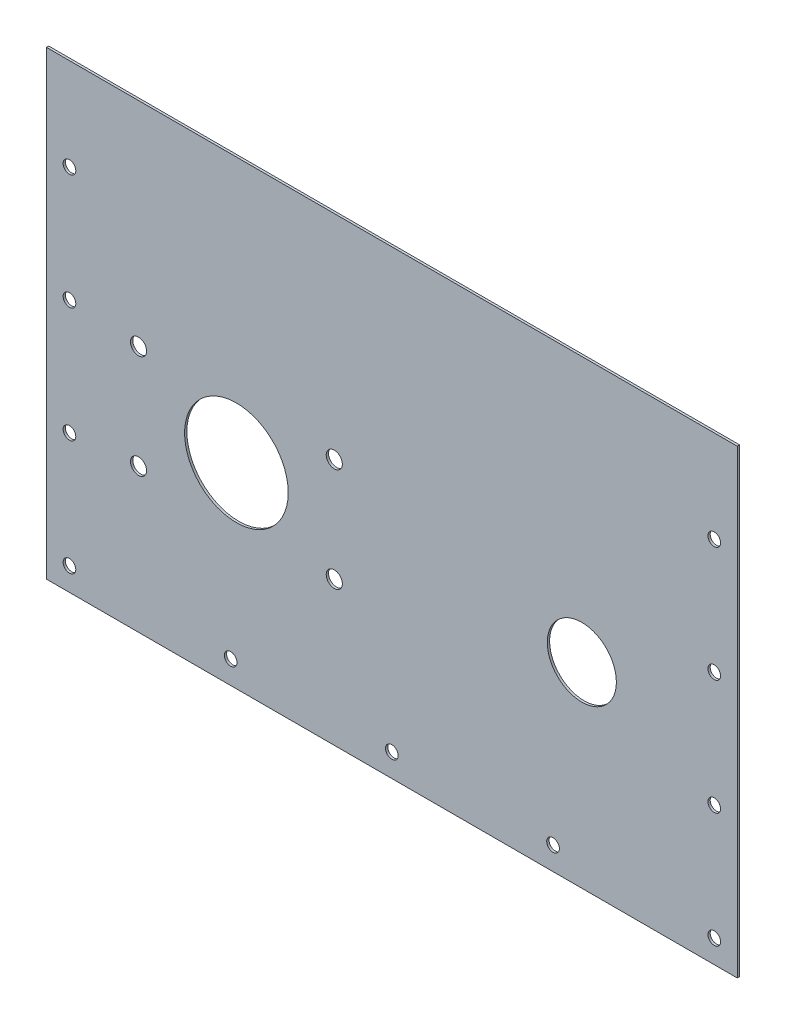
ISO-10303-21;
HEADER;
FILE_DESCRIPTION(('STEP AP214'),'2;1');
FILE_NAME('part.step','',(''),(''),'','','');
FILE_SCHEMA(('AUTOMOTIVE_DESIGN { 1 0 10303 214 1 1 1 1 }'));
ENDSEC;
DATA;
#1=APPLICATION_CONTEXT('core data for automotive mechanical design processes');
#2=APPLICATION_PROTOCOL_DEFINITION('international standard','automotive_design',2000,#1);
#3=PRODUCT_CONTEXT('',#1,'mechanical');
#4=PRODUCT('Part','Part','',(#3));
#5=PRODUCT_RELATED_PRODUCT_CATEGORY('part','',(#4));
#6=PRODUCT_DEFINITION_FORMATION('','',#4);
#7=PRODUCT_DEFINITION_CONTEXT('part definition',#1,'design');
#8=PRODUCT_DEFINITION('design','',#6,#7);
#9=PRODUCT_DEFINITION_SHAPE('','',#8);
#10=(LENGTH_UNIT() NAMED_UNIT(*) SI_UNIT(.MILLI.,.METRE.));
#11=(NAMED_UNIT(*) PLANE_ANGLE_UNIT() SI_UNIT($,.RADIAN.));
#12=(NAMED_UNIT(*) SI_UNIT($,.STERADIAN.) SOLID_ANGLE_UNIT());
#13=UNCERTAINTY_MEASURE_WITH_UNIT(LENGTH_MEASURE(1.E-05),#10,'distance_accuracy_value','');
#14=(GEOMETRIC_REPRESENTATION_CONTEXT(3) GLOBAL_UNCERTAINTY_ASSIGNED_CONTEXT((#13)) GLOBAL_UNIT_ASSIGNED_CONTEXT((#10,
#11,#12)) REPRESENTATION_CONTEXT('',''));
#15=CARTESIAN_POINT('',(0.,0.,0.));
#16=DIRECTION('',(0.,0.,1.));
#17=DIRECTION('',(1.,0.,0.));
#18=AXIS2_PLACEMENT_3D('',#15,#16,#17);
#19=CARTESIAN_POINT('',(-150.,-110.,1.));
#20=DIRECTION('',(-1.,0.,0.));
#21=DIRECTION('',(0.,0.,1.));
#22=AXIS2_PLACEMENT_3D('',#19,#20,#21);
#23=PLANE('',#22);
#24=DIRECTION('',(0.,0.,1.));
#25=VECTOR('',#24,1.);
#26=CARTESIAN_POINT('',(-150.,90.,-9.));
#27=LINE('',#26,#25);
#28=CARTESIAN_POINT('',(-150.,90.,0.));
#29=VERTEX_POINT('',#28);
#30=CARTESIAN_POINT('',(-150.,90.,1.));
#31=VERTEX_POINT('',#30);
#32=EDGE_CURVE('E92',#29,#31,#27,.T.);
#33=ORIENTED_EDGE('',*,*,#32,.F.);
#34=DIRECTION('',(0.,1.,0.));
#35=VECTOR('',#34,1.);
#36=CARTESIAN_POINT('',(-150.,-110.,0.));
#37=LINE('',#36,#35);
#38=CARTESIAN_POINT('',(-150.,-110.,0.));
#39=VERTEX_POINT('',#38);
#40=EDGE_CURVE('E85',#39,#29,#37,.T.);
#41=ORIENTED_EDGE('',*,*,#40,.F.);
#42=DIRECTION('',(0.,0.,-1.));
#43=VECTOR('',#42,1.);
#44=CARTESIAN_POINT('',(-150.,-110.,1.));
#45=LINE('',#44,#43);
#46=CARTESIAN_POINT('',(-150.,-110.,1.));
#47=VERTEX_POINT('',#46);
#48=EDGE_CURVE('E45',#47,#39,#45,.T.);
#49=ORIENTED_EDGE('',*,*,#48,.F.);
#50=DIRECTION('',(0.,1.,0.));
#51=VECTOR('',#50,1.);
#52=CARTESIAN_POINT('',(-150.,-110.,1.));
#53=LINE('',#52,#51);
#54=EDGE_CURVE('E88',#47,#31,#53,.T.);
#55=ORIENTED_EDGE('',*,*,#54,.T.);
#56=EDGE_LOOP('',(#33,#41,#49,#55));
#57=FACE_BOUND('',#56,.T.);
#58=ADVANCED_FACE('F37',(#57),#23,.T.);
#59=CARTESIAN_POINT('',(-150.,-110.,1.));
#60=DIRECTION('',(0.,1.,0.));
#61=DIRECTION('',(0.,0.,1.));
#62=AXIS2_PLACEMENT_3D('',#59,#60,#61);
#63=PLANE('',#62);
#64=DIRECTION('',(1.,0.,0.));
#65=VECTOR('',#64,1.);
#66=CARTESIAN_POINT('',(-150.,-110.,0.));
#67=LINE('',#66,#65);
#68=CARTESIAN_POINT('',(150.,-110.,0.));
#69=VERTEX_POINT('',#68);
#70=EDGE_CURVE('E74',#39,#69,#67,.T.);
#71=ORIENTED_EDGE('',*,*,#70,.T.);
#72=DIRECTION('',(0.,0.,-1.));
#73=VECTOR('',#72,1.);
#74=CARTESIAN_POINT('',(150.,-110.,1.));
#75=LINE('',#74,#73);
#76=CARTESIAN_POINT('',(150.,-110.,1.));
#77=VERTEX_POINT('',#76);
#78=EDGE_CURVE('E78',#77,#69,#75,.T.);
#79=ORIENTED_EDGE('',*,*,#78,.F.);
#80=DIRECTION('',(1.,0.,0.));
#81=VECTOR('',#80,1.);
#82=CARTESIAN_POINT('',(-150.,-110.,1.));
#83=LINE('',#82,#81);
#84=EDGE_CURVE('E76',#47,#77,#83,.T.);
#85=ORIENTED_EDGE('',*,*,#84,.F.);
#86=ORIENTED_EDGE('',*,*,#48,.T.);
#87=EDGE_LOOP('',(#71,#79,#85,#86));
#88=FACE_BOUND('',#87,.T.);
#89=ADVANCED_FACE('F72',(#88),#63,.F.);
#90=CARTESIAN_POINT('',(150.,-110.,1.));
#91=DIRECTION('',(-1.,0.,0.));
#92=DIRECTION('',(0.,0.,1.));
#93=AXIS2_PLACEMENT_3D('',#90,#91,#92);
#94=PLANE('',#93);
#95=DIRECTION('',(0.,1.,0.));
#96=VECTOR('',#95,1.);
#97=CARTESIAN_POINT('',(150.,-110.,0.));
#98=LINE('',#97,#96);
#99=CARTESIAN_POINT('',(150.,90.,0.));
#100=VERTEX_POINT('',#99);
#101=EDGE_CURVE('E87',#69,#100,#98,.T.);
#102=ORIENTED_EDGE('',*,*,#101,.T.);
#103=DIRECTION('',(0.,0.,1.));
#104=VECTOR('',#103,1.);
#105=CARTESIAN_POINT('',(150.,90.,-9.));
#106=LINE('',#105,#104);
#107=CARTESIAN_POINT('',(150.,90.,1.));
#108=VERTEX_POINT('',#107);
#109=EDGE_CURVE('E52',#100,#108,#106,.T.);
#110=ORIENTED_EDGE('',*,*,#109,.T.);
#111=DIRECTION('',(0.,1.,0.));
#112=VECTOR('',#111,1.);
#113=CARTESIAN_POINT('',(150.,-110.,1.));
#114=LINE('',#113,#112);
#115=EDGE_CURVE('E193',#77,#108,#114,.T.);
#116=ORIENTED_EDGE('',*,*,#115,.F.);
#117=ORIENTED_EDGE('',*,*,#78,.T.);
#118=EDGE_LOOP('',(#102,#110,#116,#117));
#119=FACE_BOUND('',#118,.T.);
#120=ADVANCED_FACE('F199',(#119),#94,.F.);
#121=CARTESIAN_POINT('',(0.,0.,1.));
#122=DIRECTION('',(0.,0.,-1.));
#123=DIRECTION('',(-1.,0.,0.));
#124=AXIS2_PLACEMENT_3D('',#121,#122,#123);
#125=PLANE('',#124);
#126=CARTESIAN_POINT('',(82.5,-25.,1.));
#127=DIRECTION('',(0.,0.,1.));
#128=DIRECTION('',(1.,0.,0.));
#129=AXIS2_PLACEMENT_3D('',#126,#127,#128);
#130=CIRCLE('',#129,15.);
#131=CARTESIAN_POINT('',(97.5,-25.,1.));
#132=VERTEX_POINT('',#131);
#133=EDGE_CURVE('E519',#132,#132,#130,.T.);
#134=ORIENTED_EDGE('',*,*,#133,.F.);
#135=EDGE_LOOP('',(#134));
#136=FACE_BOUND('',#135,.T.);
#137=CARTESIAN_POINT('',(-110.,-2.50000000000002,1.));
#138=DIRECTION('',(0.,0.,1.));
#139=DIRECTION('',(1.,0.,0.));
#140=AXIS2_PLACEMENT_3D('',#137,#138,#139);
#141=CIRCLE('',#140,3.50000000000001);
#142=CARTESIAN_POINT('',(-106.5,-2.50000000000002,1.));
#143=VERTEX_POINT('',#142);
#144=EDGE_CURVE('E520',#143,#143,#141,.T.);
#145=ORIENTED_EDGE('',*,*,#144,.F.);
#146=EDGE_LOOP('',(#145));
#147=FACE_BOUND('',#146,.T.);
#148=CARTESIAN_POINT('',(-110.,-47.5,1.));
#149=DIRECTION('',(0.,0.,1.));
#150=DIRECTION('',(1.,0.,0.));
#151=AXIS2_PLACEMENT_3D('',#148,#149,#150);
#152=CIRCLE('',#151,3.50000000000001);
#153=CARTESIAN_POINT('',(-106.5,-47.5,1.));
#154=VERTEX_POINT('',#153);
#155=EDGE_CURVE('E524',#154,#154,#152,.T.);
#156=ORIENTED_EDGE('',*,*,#155,.F.);
#157=EDGE_LOOP('',(#156));
#158=FACE_BOUND('',#157,.T.);
#159=CARTESIAN_POINT('',(-25.,-47.5,1.));
#160=DIRECTION('',(0.,0.,1.));
#161=DIRECTION('',(1.,0.,0.));
#162=AXIS2_PLACEMENT_3D('',#159,#160,#161);
#163=CIRCLE('',#162,3.5);
#164=CARTESIAN_POINT('',(-21.5,-47.5,1.));
#165=VERTEX_POINT('',#164);
#166=EDGE_CURVE('E530',#165,#165,#163,.T.);
#167=ORIENTED_EDGE('',*,*,#166,.F.);
#168=EDGE_LOOP('',(#167));
#169=FACE_BOUND('',#168,.T.);
#170=CARTESIAN_POINT('',(-25.,-2.50000000000002,1.));
#171=DIRECTION('',(0.,0.,1.));
#172=DIRECTION('',(1.,0.,0.));
#173=AXIS2_PLACEMENT_3D('',#170,#171,#172);
#174=CIRCLE('',#173,3.5);
#175=CARTESIAN_POINT('',(-21.5,-2.50000000000002,1.));
#176=VERTEX_POINT('',#175);
#177=EDGE_CURVE('E527',#176,#176,#174,.T.);
#178=ORIENTED_EDGE('',*,*,#177,.F.);
#179=EDGE_LOOP('',(#178));
#180=FACE_BOUND('',#179,.T.);
#181=CARTESIAN_POINT('',(-67.5,-25.,1.));
#182=DIRECTION('',(0.,0.,1.));
#183=DIRECTION('',(1.,0.,0.));
#184=AXIS2_PLACEMENT_3D('',#181,#182,#183);
#185=CIRCLE('',#184,22.5);
#186=CARTESIAN_POINT('',(-45.,-25.,1.));
#187=VERTEX_POINT('',#186);
#188=EDGE_CURVE('E107',#187,#187,#185,.T.);
#189=ORIENTED_EDGE('',*,*,#188,.F.);
#190=EDGE_LOOP('',(#189));
#191=FACE_BOUND('',#190,.T.);
#192=CARTESIAN_POINT('',(-140.,50.,1.));
#193=DIRECTION('',(0.,0.,-1.));
#194=DIRECTION('',(-1.,0.,0.));
#195=AXIS2_PLACEMENT_3D('',#192,#193,#194);
#196=CIRCLE('',#195,2.75);
#197=CARTESIAN_POINT('',(-142.75,50.,1.));
#198=VERTEX_POINT('',#197);
#199=EDGE_CURVE('E134',#198,#198,#196,.T.);
#200=ORIENTED_EDGE('',*,*,#199,.T.);
#201=EDGE_LOOP('',(#200));
#202=FACE_BOUND('',#201,.T.);
#203=CARTESIAN_POINT('',(-140.,-50.,1.));
#204=DIRECTION('',(0.,0.,-1.));
#205=DIRECTION('',(-1.,0.,0.));
#206=AXIS2_PLACEMENT_3D('',#203,#204,#205);
#207=CIRCLE('',#206,2.75);
#208=CARTESIAN_POINT('',(-142.75,-50.,1.));
#209=VERTEX_POINT('',#208);
#210=EDGE_CURVE('E140',#209,#209,#207,.T.);
#211=ORIENTED_EDGE('',*,*,#210,.T.);
#212=EDGE_LOOP('',(#211));
#213=FACE_BOUND('',#212,.T.);
#214=CARTESIAN_POINT('',(-140.,0.,1.));
#215=DIRECTION('',(0.,0.,-1.));
#216=DIRECTION('',(-1.,0.,0.));
#217=AXIS2_PLACEMENT_3D('',#214,#215,#216);
#218=CIRCLE('',#217,2.75);
#219=CARTESIAN_POINT('',(-142.75,0.,1.));
#220=VERTEX_POINT('',#219);
#221=EDGE_CURVE('E146',#220,#220,#218,.T.);
#222=ORIENTED_EDGE('',*,*,#221,.T.);
#223=EDGE_LOOP('',(#222));
#224=FACE_BOUND('',#223,.T.);
#225=CARTESIAN_POINT('',(-140.,-100.,1.));
#226=DIRECTION('',(0.,0.,-1.));
#227=DIRECTION('',(-1.,0.,0.));
#228=AXIS2_PLACEMENT_3D('',#225,#226,#227);
#229=CIRCLE('',#228,2.75);
#230=CARTESIAN_POINT('',(-142.75,-100.,1.));
#231=VERTEX_POINT('',#230);
#232=EDGE_CURVE('E152',#231,#231,#229,.T.);
#233=ORIENTED_EDGE('',*,*,#232,.T.);
#234=EDGE_LOOP('',(#233));
#235=FACE_BOUND('',#234,.T.);
#236=CARTESIAN_POINT('',(140.,50.0000000000001,1.));
#237=DIRECTION('',(0.,0.,-1.));
#238=DIRECTION('',(-1.,0.,0.));
#239=AXIS2_PLACEMENT_3D('',#236,#237,#238);
#240=CIRCLE('',#239,2.75);
#241=CARTESIAN_POINT('',(137.25,50.0000000000001,1.));
#242=VERTEX_POINT('',#241);
#243=EDGE_CURVE('E158',#242,#242,#240,.T.);
#244=ORIENTED_EDGE('',*,*,#243,.T.);
#245=EDGE_LOOP('',(#244));
#246=FACE_BOUND('',#245,.T.);
#247=CARTESIAN_POINT('',(140.,-50.,1.));
#248=DIRECTION('',(0.,0.,-1.));
#249=DIRECTION('',(-1.,0.,0.));
#250=AXIS2_PLACEMENT_3D('',#247,#248,#249);
#251=CIRCLE('',#250,2.75);
#252=CARTESIAN_POINT('',(137.25,-50.,1.));
#253=VERTEX_POINT('',#252);
#254=EDGE_CURVE('E164',#253,#253,#251,.T.);
#255=ORIENTED_EDGE('',*,*,#254,.T.);
#256=EDGE_LOOP('',(#255));
#257=FACE_BOUND('',#256,.T.);
#258=CARTESIAN_POINT('',(140.,0.,1.));
#259=DIRECTION('',(0.,0.,-1.));
#260=DIRECTION('',(-1.,0.,0.));
#261=AXIS2_PLACEMENT_3D('',#258,#259,#260);
#262=CIRCLE('',#261,2.75);
#263=CARTESIAN_POINT('',(137.25,0.,1.));
#264=VERTEX_POINT('',#263);
#265=EDGE_CURVE('E170',#264,#264,#262,.T.);
#266=ORIENTED_EDGE('',*,*,#265,.T.);
#267=EDGE_LOOP('',(#266));
#268=FACE_BOUND('',#267,.T.);
#269=CARTESIAN_POINT('',(140.,-100.,1.));
#270=DIRECTION('',(0.,0.,-1.));
#271=DIRECTION('',(-1.,0.,0.));
#272=AXIS2_PLACEMENT_3D('',#269,#270,#271);
#273=CIRCLE('',#272,2.75);
#274=CARTESIAN_POINT('',(137.25,-100.,1.));
#275=VERTEX_POINT('',#274);
#276=EDGE_CURVE('E176',#275,#275,#273,.T.);
#277=ORIENTED_EDGE('',*,*,#276,.T.);
#278=EDGE_LOOP('',(#277));
#279=FACE_BOUND('',#278,.T.);
#280=CARTESIAN_POINT('',(70.,-100.,1.));
#281=DIRECTION('',(0.,0.,-1.));
#282=DIRECTION('',(-1.,0.,0.));
#283=AXIS2_PLACEMENT_3D('',#280,#281,#282);
#284=CIRCLE('',#283,2.75);
#285=CARTESIAN_POINT('',(67.25,-100.,1.));
#286=VERTEX_POINT('',#285);
#287=EDGE_CURVE('E182',#286,#286,#284,.T.);
#288=ORIENTED_EDGE('',*,*,#287,.T.);
#289=EDGE_LOOP('',(#288));
#290=FACE_BOUND('',#289,.T.);
#291=CARTESIAN_POINT('',(-70.,-100.,1.));
#292=DIRECTION('',(0.,0.,-1.));
#293=DIRECTION('',(-1.,0.,0.));
#294=AXIS2_PLACEMENT_3D('',#291,#292,#293);
#295=CIRCLE('',#294,2.75);
#296=CARTESIAN_POINT('',(-72.75,-100.,1.));
#297=VERTEX_POINT('',#296);
#298=EDGE_CURVE('E188',#297,#297,#295,.T.);
#299=ORIENTED_EDGE('',*,*,#298,.T.);
#300=EDGE_LOOP('',(#299));
#301=FACE_BOUND('',#300,.T.);
#302=CARTESIAN_POINT('',(0.,-100.,1.));
#303=DIRECTION('',(0.,0.,-1.));
#304=DIRECTION('',(-1.,0.,0.));
#305=AXIS2_PLACEMENT_3D('',#302,#303,#304);
#306=CIRCLE('',#305,2.75);
#307=CARTESIAN_POINT('',(-2.74999999999997,-100.,1.));
#308=VERTEX_POINT('',#307);
#309=EDGE_CURVE('E93',#308,#308,#306,.T.);
#310=ORIENTED_EDGE('',*,*,#309,.T.);
#311=EDGE_LOOP('',(#310));
#312=FACE_BOUND('',#311,.T.);
#313=ORIENTED_EDGE('',*,*,#115,.T.);
#314=DIRECTION('',(1.,0.,0.));
#315=VECTOR('',#314,1.);
#316=CARTESIAN_POINT('',(-150.,90.,1.));
#317=LINE('',#316,#315);
#318=EDGE_CURVE('E120',#31,#108,#317,.T.);
#319=ORIENTED_EDGE('',*,*,#318,.F.);
#320=ORIENTED_EDGE('',*,*,#54,.F.);
#321=ORIENTED_EDGE('',*,*,#84,.T.);
#322=EDGE_LOOP('',(#313,#319,#320,#321));
#323=FACE_BOUND('',#322,.T.);
#324=ADVANCED_FACE('F197',(#136,#147,#158,#169,#180,#191,#202,#213,#224,#235,#246,#257,#268,
#279,#290,#301,#312,#323),#125,.F.);
#325=CARTESIAN_POINT('',(0.,0.,0.));
#326=DIRECTION('',(0.,0.,-1.));
#327=DIRECTION('',(-1.,0.,0.));
#328=AXIS2_PLACEMENT_3D('',#325,#326,#327);
#329=PLANE('',#328);
#330=CARTESIAN_POINT('',(82.5,-25.,0.));
#331=DIRECTION('',(0.,0.,-1.));
#332=DIRECTION('',(-1.,0.,0.));
#333=AXIS2_PLACEMENT_3D('',#330,#331,#332);
#334=CIRCLE('',#333,15.);
#335=CARTESIAN_POINT('',(67.5,-25.,0.));
#336=VERTEX_POINT('',#335);
#337=EDGE_CURVE('E40',#336,#336,#334,.T.);
#338=ORIENTED_EDGE('',*,*,#337,.F.);
#339=EDGE_LOOP('',(#338));
#340=FACE_BOUND('',#339,.T.);
#341=CARTESIAN_POINT('',(-110.,-2.50000000000002,0.));
#342=DIRECTION('',(0.,0.,-1.));
#343=DIRECTION('',(-1.,0.,0.));
#344=AXIS2_PLACEMENT_3D('',#341,#342,#343);
#345=CIRCLE('',#344,3.50000000000001);
#346=CARTESIAN_POINT('',(-113.5,-2.50000000000002,0.));
#347=VERTEX_POINT('',#346);
#348=EDGE_CURVE('E115',#347,#347,#345,.T.);
#349=ORIENTED_EDGE('',*,*,#348,.F.);
#350=EDGE_LOOP('',(#349));
#351=FACE_BOUND('',#350,.T.);
#352=CARTESIAN_POINT('',(-110.,-47.5,0.));
#353=DIRECTION('',(0.,0.,-1.));
#354=DIRECTION('',(-1.,0.,0.));
#355=AXIS2_PLACEMENT_3D('',#352,#353,#354);
#356=CIRCLE('',#355,3.50000000000001);
#357=CARTESIAN_POINT('',(-113.5,-47.5,0.));
#358=VERTEX_POINT('',#357);
#359=EDGE_CURVE('E113',#358,#358,#356,.T.);
#360=ORIENTED_EDGE('',*,*,#359,.F.);
#361=EDGE_LOOP('',(#360));
#362=FACE_BOUND('',#361,.T.);
#363=CARTESIAN_POINT('',(-25.,-47.5,0.));
#364=DIRECTION('',(0.,0.,-1.));
#365=DIRECTION('',(-1.,0.,0.));
#366=AXIS2_PLACEMENT_3D('',#363,#364,#365);
#367=CIRCLE('',#366,3.5);
#368=CARTESIAN_POINT('',(-28.5,-47.5,0.));
#369=VERTEX_POINT('',#368);
#370=EDGE_CURVE('E110',#369,#369,#367,.T.);
#371=ORIENTED_EDGE('',*,*,#370,.F.);
#372=EDGE_LOOP('',(#371));
#373=FACE_BOUND('',#372,.T.);
#374=CARTESIAN_POINT('',(-25.,-2.50000000000002,0.));
#375=DIRECTION('',(0.,0.,-1.));
#376=DIRECTION('',(-1.,0.,0.));
#377=AXIS2_PLACEMENT_3D('',#374,#375,#376);
#378=CIRCLE('',#377,3.5);
#379=CARTESIAN_POINT('',(-28.5,-2.50000000000002,0.));
#380=VERTEX_POINT('',#379);
#381=EDGE_CURVE('E106',#380,#380,#378,.T.);
#382=ORIENTED_EDGE('',*,*,#381,.F.);
#383=EDGE_LOOP('',(#382));
#384=FACE_BOUND('',#383,.T.);
#385=CARTESIAN_POINT('',(-67.5,-25.,0.));
#386=DIRECTION('',(0.,0.,-1.));
#387=DIRECTION('',(-1.,0.,0.));
#388=AXIS2_PLACEMENT_3D('',#385,#386,#387);
#389=CIRCLE('',#388,22.5);
#390=CARTESIAN_POINT('',(-90.,-25.,0.));
#391=VERTEX_POINT('',#390);
#392=EDGE_CURVE('E103',#391,#391,#389,.T.);
#393=ORIENTED_EDGE('',*,*,#392,.F.);
#394=EDGE_LOOP('',(#393));
#395=FACE_BOUND('',#394,.T.);
#396=DIRECTION('',(-1.,0.,0.));
#397=VECTOR('',#396,1.);
#398=CARTESIAN_POINT('',(0.,90.,0.));
#399=LINE('',#398,#397);
#400=EDGE_CURVE('E11',#100,#29,#399,.T.);
#401=ORIENTED_EDGE('',*,*,#400,.F.);
#402=ORIENTED_EDGE('',*,*,#101,.F.);
#403=ORIENTED_EDGE('',*,*,#70,.F.);
#404=ORIENTED_EDGE('',*,*,#40,.T.);
#405=EDGE_LOOP('',(#401,#402,#403,#404));
#406=FACE_BOUND('',#405,.T.);
#407=CARTESIAN_POINT('',(-140.,50.,0.));
#408=DIRECTION('',(0.,0.,-1.));
#409=DIRECTION('',(-1.,0.,0.));
#410=AXIS2_PLACEMENT_3D('',#407,#408,#409);
#411=CIRCLE('',#410,2.75);
#412=CARTESIAN_POINT('',(-142.75,50.,0.));
#413=VERTEX_POINT('',#412);
#414=EDGE_CURVE('E130',#413,#413,#411,.T.);
#415=ORIENTED_EDGE('',*,*,#414,.F.);
#416=EDGE_LOOP('',(#415));
#417=FACE_BOUND('',#416,.T.);
#418=CARTESIAN_POINT('',(-140.,-50.,0.));
#419=DIRECTION('',(0.,0.,-1.));
#420=DIRECTION('',(-1.,0.,0.));
#421=AXIS2_PLACEMENT_3D('',#418,#419,#420);
#422=CIRCLE('',#421,2.75);
#423=CARTESIAN_POINT('',(-142.75,-50.,0.));
#424=VERTEX_POINT('',#423);
#425=EDGE_CURVE('E137',#424,#424,#422,.T.);
#426=ORIENTED_EDGE('',*,*,#425,.F.);
#427=EDGE_LOOP('',(#426));
#428=FACE_BOUND('',#427,.T.);
#429=CARTESIAN_POINT('',(-140.,0.,0.));
#430=DIRECTION('',(0.,0.,-1.));
#431=DIRECTION('',(-1.,0.,0.));
#432=AXIS2_PLACEMENT_3D('',#429,#430,#431);
#433=CIRCLE('',#432,2.75);
#434=CARTESIAN_POINT('',(-142.75,0.,0.));
#435=VERTEX_POINT('',#434);
#436=EDGE_CURVE('E143',#435,#435,#433,.T.);
#437=ORIENTED_EDGE('',*,*,#436,.F.);
#438=EDGE_LOOP('',(#437));
#439=FACE_BOUND('',#438,.T.);
#440=CARTESIAN_POINT('',(-140.,-100.,0.));
#441=DIRECTION('',(0.,0.,-1.));
#442=DIRECTION('',(-1.,0.,0.));
#443=AXIS2_PLACEMENT_3D('',#440,#441,#442);
#444=CIRCLE('',#443,2.75);
#445=CARTESIAN_POINT('',(-142.75,-100.,0.));
#446=VERTEX_POINT('',#445);
#447=EDGE_CURVE('E149',#446,#446,#444,.T.);
#448=ORIENTED_EDGE('',*,*,#447,.F.);
#449=EDGE_LOOP('',(#448));
#450=FACE_BOUND('',#449,.T.);
#451=CARTESIAN_POINT('',(140.,50.0000000000001,0.));
#452=DIRECTION('',(0.,0.,-1.));
#453=DIRECTION('',(-1.,0.,0.));
#454=AXIS2_PLACEMENT_3D('',#451,#452,#453);
#455=CIRCLE('',#454,2.75);
#456=CARTESIAN_POINT('',(137.25,50.0000000000001,0.));
#457=VERTEX_POINT('',#456);
#458=EDGE_CURVE('E155',#457,#457,#455,.T.);
#459=ORIENTED_EDGE('',*,*,#458,.F.);
#460=EDGE_LOOP('',(#459));
#461=FACE_BOUND('',#460,.T.);
#462=CARTESIAN_POINT('',(140.,-50.,0.));
#463=DIRECTION('',(0.,0.,-1.));
#464=DIRECTION('',(-1.,0.,0.));
#465=AXIS2_PLACEMENT_3D('',#462,#463,#464);
#466=CIRCLE('',#465,2.75);
#467=CARTESIAN_POINT('',(137.25,-50.,0.));
#468=VERTEX_POINT('',#467);
#469=EDGE_CURVE('E161',#468,#468,#466,.T.);
#470=ORIENTED_EDGE('',*,*,#469,.F.);
#471=EDGE_LOOP('',(#470));
#472=FACE_BOUND('',#471,.T.);
#473=CARTESIAN_POINT('',(140.,0.,0.));
#474=DIRECTION('',(0.,0.,-1.));
#475=DIRECTION('',(-1.,0.,0.));
#476=AXIS2_PLACEMENT_3D('',#473,#474,#475);
#477=CIRCLE('',#476,2.75);
#478=CARTESIAN_POINT('',(137.25,0.,0.));
#479=VERTEX_POINT('',#478);
#480=EDGE_CURVE('E167',#479,#479,#477,.T.);
#481=ORIENTED_EDGE('',*,*,#480,.F.);
#482=EDGE_LOOP('',(#481));
#483=FACE_BOUND('',#482,.T.);
#484=CARTESIAN_POINT('',(140.,-100.,0.));
#485=DIRECTION('',(0.,0.,-1.));
#486=DIRECTION('',(-1.,0.,0.));
#487=AXIS2_PLACEMENT_3D('',#484,#485,#486);
#488=CIRCLE('',#487,2.75);
#489=CARTESIAN_POINT('',(137.25,-100.,0.));
#490=VERTEX_POINT('',#489);
#491=EDGE_CURVE('E173',#490,#490,#488,.T.);
#492=ORIENTED_EDGE('',*,*,#491,.F.);
#493=EDGE_LOOP('',(#492));
#494=FACE_BOUND('',#493,.T.);
#495=CARTESIAN_POINT('',(70.,-100.,0.));
#496=DIRECTION('',(0.,0.,-1.));
#497=DIRECTION('',(-1.,0.,0.));
#498=AXIS2_PLACEMENT_3D('',#495,#496,#497);
#499=CIRCLE('',#498,2.75);
#500=CARTESIAN_POINT('',(67.25,-100.,0.));
#501=VERTEX_POINT('',#500);
#502=EDGE_CURVE('E179',#501,#501,#499,.T.);
#503=ORIENTED_EDGE('',*,*,#502,.F.);
#504=EDGE_LOOP('',(#503));
#505=FACE_BOUND('',#504,.T.);
#506=CARTESIAN_POINT('',(-70.,-100.,0.));
#507=DIRECTION('',(0.,0.,-1.));
#508=DIRECTION('',(-1.,0.,0.));
#509=AXIS2_PLACEMENT_3D('',#506,#507,#508);
#510=CIRCLE('',#509,2.75);
#511=CARTESIAN_POINT('',(-72.75,-100.,0.));
#512=VERTEX_POINT('',#511);
#513=EDGE_CURVE('E185',#512,#512,#510,.T.);
#514=ORIENTED_EDGE('',*,*,#513,.F.);
#515=EDGE_LOOP('',(#514));
#516=FACE_BOUND('',#515,.T.);
#517=CARTESIAN_POINT('',(0.,-100.,0.));
#518=DIRECTION('',(0.,0.,-1.));
#519=DIRECTION('',(-1.,0.,0.));
#520=AXIS2_PLACEMENT_3D('',#517,#518,#519);
#521=CIRCLE('',#520,2.75);
#522=CARTESIAN_POINT('',(-2.74999999999997,-100.,0.));
#523=VERTEX_POINT('',#522);
#524=EDGE_CURVE('E97',#523,#523,#521,.T.);
#525=ORIENTED_EDGE('',*,*,#524,.F.);
#526=EDGE_LOOP('',(#525));
#527=FACE_BOUND('',#526,.T.);
#528=ADVANCED_FACE('F83',(#340,#351,#362,#373,#384,#395,#406,#417,#428,#439,#450,#461,#472,#483,
#494,#505,#516,#527),#329,.T.);
#529=CARTESIAN_POINT('',(0.,-100.,0.));
#530=DIRECTION('',(0.,0.,-1.));
#531=DIRECTION('',(-1.,0.,0.));
#532=AXIS2_PLACEMENT_3D('',#529,#530,#531);
#533=CYLINDRICAL_SURFACE('',#532,2.75);
#534=ORIENTED_EDGE('',*,*,#309,.F.);
#535=EDGE_LOOP('',(#534));
#536=FACE_BOUND('',#535,.T.);
#537=ORIENTED_EDGE('',*,*,#524,.T.);
#538=EDGE_LOOP('',(#537));
#539=FACE_BOUND('',#538,.T.);
#540=ADVANCED_FACE('F229',(#536,#539),#533,.F.);
#541=CARTESIAN_POINT('',(-70.,-100.,0.));
#542=DIRECTION('',(0.,0.,-1.));
#543=DIRECTION('',(-1.,0.,0.));
#544=AXIS2_PLACEMENT_3D('',#541,#542,#543);
#545=CYLINDRICAL_SURFACE('',#544,2.75);
#546=ORIENTED_EDGE('',*,*,#298,.F.);
#547=EDGE_LOOP('',(#546));
#548=FACE_BOUND('',#547,.T.);
#549=ORIENTED_EDGE('',*,*,#513,.T.);
#550=EDGE_LOOP('',(#549));
#551=FACE_BOUND('',#550,.T.);
#552=ADVANCED_FACE('F236',(#548,#551),#545,.F.);
#553=CARTESIAN_POINT('',(70.,-100.,0.));
#554=DIRECTION('',(0.,0.,-1.));
#555=DIRECTION('',(-1.,0.,0.));
#556=AXIS2_PLACEMENT_3D('',#553,#554,#555);
#557=CYLINDRICAL_SURFACE('',#556,2.75);
#558=ORIENTED_EDGE('',*,*,#287,.F.);
#559=EDGE_LOOP('',(#558));
#560=FACE_BOUND('',#559,.T.);
#561=ORIENTED_EDGE('',*,*,#502,.T.);
#562=EDGE_LOOP('',(#561));
#563=FACE_BOUND('',#562,.T.);
#564=ADVANCED_FACE('F240',(#560,#563),#557,.F.);
#565=CARTESIAN_POINT('',(140.,-100.,0.));
#566=DIRECTION('',(0.,0.,-1.));
#567=DIRECTION('',(-1.,0.,0.));
#568=AXIS2_PLACEMENT_3D('',#565,#566,#567);
#569=CYLINDRICAL_SURFACE('',#568,2.75);
#570=ORIENTED_EDGE('',*,*,#276,.F.);
#571=EDGE_LOOP('',(#570));
#572=FACE_BOUND('',#571,.T.);
#573=ORIENTED_EDGE('',*,*,#491,.T.);
#574=EDGE_LOOP('',(#573));
#575=FACE_BOUND('',#574,.T.);
#576=ADVANCED_FACE('F244',(#572,#575),#569,.F.);
#577=CARTESIAN_POINT('',(140.,0.,0.));
#578=DIRECTION('',(0.,0.,-1.));
#579=DIRECTION('',(-1.,0.,0.));
#580=AXIS2_PLACEMENT_3D('',#577,#578,#579);
#581=CYLINDRICAL_SURFACE('',#580,2.75);
#582=ORIENTED_EDGE('',*,*,#265,.F.);
#583=EDGE_LOOP('',(#582));
#584=FACE_BOUND('',#583,.T.);
#585=ORIENTED_EDGE('',*,*,#480,.T.);
#586=EDGE_LOOP('',(#585));
#587=FACE_BOUND('',#586,.T.);
#588=ADVANCED_FACE('F248',(#584,#587),#581,.F.);
#589=CARTESIAN_POINT('',(140.,-50.,0.));
#590=DIRECTION('',(0.,0.,-1.));
#591=DIRECTION('',(-1.,0.,0.));
#592=AXIS2_PLACEMENT_3D('',#589,#590,#591);
#593=CYLINDRICAL_SURFACE('',#592,2.75);
#594=ORIENTED_EDGE('',*,*,#254,.F.);
#595=EDGE_LOOP('',(#594));
#596=FACE_BOUND('',#595,.T.);
#597=ORIENTED_EDGE('',*,*,#469,.T.);
#598=EDGE_LOOP('',(#597));
#599=FACE_BOUND('',#598,.T.);
#600=ADVANCED_FACE('F252',(#596,#599),#593,.F.);
#601=CARTESIAN_POINT('',(140.,50.0000000000001,0.));
#602=DIRECTION('',(0.,0.,-1.));
#603=DIRECTION('',(-1.,0.,0.));
#604=AXIS2_PLACEMENT_3D('',#601,#602,#603);
#605=CYLINDRICAL_SURFACE('',#604,2.75);
#606=ORIENTED_EDGE('',*,*,#243,.F.);
#607=EDGE_LOOP('',(#606));
#608=FACE_BOUND('',#607,.T.);
#609=ORIENTED_EDGE('',*,*,#458,.T.);
#610=EDGE_LOOP('',(#609));
#611=FACE_BOUND('',#610,.T.);
#612=ADVANCED_FACE('F256',(#608,#611),#605,.F.);
#613=CARTESIAN_POINT('',(-140.,-100.,0.));
#614=DIRECTION('',(0.,0.,-1.));
#615=DIRECTION('',(-1.,0.,0.));
#616=AXIS2_PLACEMENT_3D('',#613,#614,#615);
#617=CYLINDRICAL_SURFACE('',#616,2.75);
#618=ORIENTED_EDGE('',*,*,#232,.F.);
#619=EDGE_LOOP('',(#618));
#620=FACE_BOUND('',#619,.T.);
#621=ORIENTED_EDGE('',*,*,#447,.T.);
#622=EDGE_LOOP('',(#621));
#623=FACE_BOUND('',#622,.T.);
#624=ADVANCED_FACE('F260',(#620,#623),#617,.F.);
#625=CARTESIAN_POINT('',(-140.,0.,0.));
#626=DIRECTION('',(0.,0.,-1.));
#627=DIRECTION('',(-1.,0.,0.));
#628=AXIS2_PLACEMENT_3D('',#625,#626,#627);
#629=CYLINDRICAL_SURFACE('',#628,2.75);
#630=ORIENTED_EDGE('',*,*,#221,.F.);
#631=EDGE_LOOP('',(#630));
#632=FACE_BOUND('',#631,.T.);
#633=ORIENTED_EDGE('',*,*,#436,.T.);
#634=EDGE_LOOP('',(#633));
#635=FACE_BOUND('',#634,.T.);
#636=ADVANCED_FACE('F264',(#632,#635),#629,.F.);
#637=CARTESIAN_POINT('',(-140.,-50.,0.));
#638=DIRECTION('',(0.,0.,-1.));
#639=DIRECTION('',(-1.,0.,0.));
#640=AXIS2_PLACEMENT_3D('',#637,#638,#639);
#641=CYLINDRICAL_SURFACE('',#640,2.75);
#642=ORIENTED_EDGE('',*,*,#210,.F.);
#643=EDGE_LOOP('',(#642));
#644=FACE_BOUND('',#643,.T.);
#645=ORIENTED_EDGE('',*,*,#425,.T.);
#646=EDGE_LOOP('',(#645));
#647=FACE_BOUND('',#646,.T.);
#648=ADVANCED_FACE('F215',(#644,#647),#641,.F.);
#649=CARTESIAN_POINT('',(-140.,50.,0.));
#650=DIRECTION('',(0.,0.,-1.));
#651=DIRECTION('',(-1.,0.,0.));
#652=AXIS2_PLACEMENT_3D('',#649,#650,#651);
#653=CYLINDRICAL_SURFACE('',#652,2.75);
#654=ORIENTED_EDGE('',*,*,#199,.F.);
#655=EDGE_LOOP('',(#654));
#656=FACE_BOUND('',#655,.T.);
#657=ORIENTED_EDGE('',*,*,#414,.T.);
#658=EDGE_LOOP('',(#657));
#659=FACE_BOUND('',#658,.T.);
#660=ADVANCED_FACE('F206',(#656,#659),#653,.F.);
#661=CARTESIAN_POINT('',(-150.,90.,-9.));
#662=DIRECTION('',(0.,-1.,0.));
#663=DIRECTION('',(0.,0.,-1.));
#664=AXIS2_PLACEMENT_3D('',#661,#662,#663);
#665=PLANE('',#664);
#666=ORIENTED_EDGE('',*,*,#400,.T.);
#667=ORIENTED_EDGE('',*,*,#32,.T.);
#668=ORIENTED_EDGE('',*,*,#318,.T.);
#669=ORIENTED_EDGE('',*,*,#109,.F.);
#670=EDGE_LOOP('',(#666,#667,#668,#669));
#671=FACE_BOUND('',#670,.T.);
#672=ADVANCED_FACE('F203',(#671),#665,.F.);
#673=CARTESIAN_POINT('',(-67.5,-25.,-9.));
#674=DIRECTION('',(0.,0.,1.));
#675=DIRECTION('',(1.,0.,0.));
#676=AXIS2_PLACEMENT_3D('',#673,#674,#675);
#677=CYLINDRICAL_SURFACE('',#676,22.5);
#678=ORIENTED_EDGE('',*,*,#392,.T.);
#679=EDGE_LOOP('',(#678));
#680=FACE_BOUND('',#679,.T.);
#681=ORIENTED_EDGE('',*,*,#188,.T.);
#682=EDGE_LOOP('',(#681));
#683=FACE_BOUND('',#682,.T.);
#684=ADVANCED_FACE('F205',(#680,#683),#677,.F.);
#685=CARTESIAN_POINT('',(-25.,-2.50000000000002,-9.));
#686=DIRECTION('',(0.,0.,1.));
#687=DIRECTION('',(1.,0.,0.));
#688=AXIS2_PLACEMENT_3D('',#685,#686,#687);
#689=CYLINDRICAL_SURFACE('',#688,3.5);
#690=ORIENTED_EDGE('',*,*,#381,.T.);
#691=EDGE_LOOP('',(#690));
#692=FACE_BOUND('',#691,.T.);
#693=ORIENTED_EDGE('',*,*,#177,.T.);
#694=EDGE_LOOP('',(#693));
#695=FACE_BOUND('',#694,.T.);
#696=ADVANCED_FACE('F212',(#692,#695),#689,.F.);
#697=CARTESIAN_POINT('',(-25.,-47.5,-9.));
#698=DIRECTION('',(0.,0.,1.));
#699=DIRECTION('',(1.,0.,0.));
#700=AXIS2_PLACEMENT_3D('',#697,#698,#699);
#701=CYLINDRICAL_SURFACE('',#700,3.5);
#702=ORIENTED_EDGE('',*,*,#370,.T.);
#703=EDGE_LOOP('',(#702));
#704=FACE_BOUND('',#703,.T.);
#705=ORIENTED_EDGE('',*,*,#166,.T.);
#706=EDGE_LOOP('',(#705));
#707=FACE_BOUND('',#706,.T.);
#708=ADVANCED_FACE('F379',(#704,#707),#701,.F.);
#709=CARTESIAN_POINT('',(-110.,-47.5,-9.));
#710=DIRECTION('',(0.,0.,1.));
#711=DIRECTION('',(1.,0.,0.));
#712=AXIS2_PLACEMENT_3D('',#709,#710,#711);
#713=CYLINDRICAL_SURFACE('',#712,3.50000000000001);
#714=ORIENTED_EDGE('',*,*,#359,.T.);
#715=EDGE_LOOP('',(#714));
#716=FACE_BOUND('',#715,.T.);
#717=ORIENTED_EDGE('',*,*,#155,.T.);
#718=EDGE_LOOP('',(#717));
#719=FACE_BOUND('',#718,.T.);
#720=ADVANCED_FACE('F390',(#716,#719),#713,.F.);
#721=CARTESIAN_POINT('',(-110.,-2.50000000000002,-9.));
#722=DIRECTION('',(0.,0.,1.));
#723=DIRECTION('',(1.,0.,0.));
#724=AXIS2_PLACEMENT_3D('',#721,#722,#723);
#725=CYLINDRICAL_SURFACE('',#724,3.50000000000001);
#726=ORIENTED_EDGE('',*,*,#348,.T.);
#727=EDGE_LOOP('',(#726));
#728=FACE_BOUND('',#727,.T.);
#729=ORIENTED_EDGE('',*,*,#144,.T.);
#730=EDGE_LOOP('',(#729));
#731=FACE_BOUND('',#730,.T.);
#732=ADVANCED_FACE('F401',(#728,#731),#725,.F.);
#733=CARTESIAN_POINT('',(82.5,-25.,-9.));
#734=DIRECTION('',(0.,0.,1.));
#735=DIRECTION('',(1.,0.,0.));
#736=AXIS2_PLACEMENT_3D('',#733,#734,#735);
#737=CYLINDRICAL_SURFACE('',#736,15.);
#738=ORIENTED_EDGE('',*,*,#337,.T.);
#739=EDGE_LOOP('',(#738));
#740=FACE_BOUND('',#739,.T.);
#741=ORIENTED_EDGE('',*,*,#133,.T.);
#742=EDGE_LOOP('',(#741));
#743=FACE_BOUND('',#742,.T.);
#744=ADVANCED_FACE('F412',(#740,#743),#737,.F.);
#745=CLOSED_SHELL('',(#58,#89,#120,#324,#528,#540,#552,#564,#576,#588,#600,#612,#624,#636,#648,
#660,#672,#684,#696,#708,#720,#732,#744));
#746=MANIFOLD_SOLID_BREP('B2',#745);
#747=ADVANCED_BREP_SHAPE_REPRESENTATION('',(#18,#746),#14);
#748=SHAPE_DEFINITION_REPRESENTATION(#9,#747);
ENDSEC;
END-ISO-10303-21;
